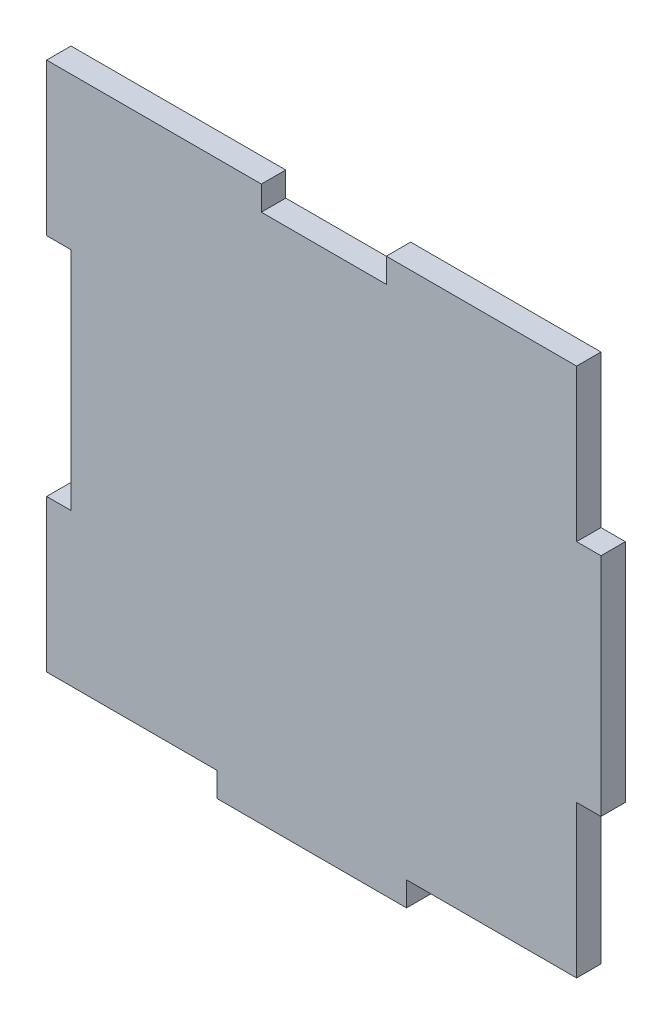
ISO-10303-21;
HEADER;
FILE_DESCRIPTION(('STEP AP214'),'2;1');
FILE_NAME('part.step','',(''),(''),'','','');
FILE_SCHEMA(('AUTOMOTIVE_DESIGN { 1 0 10303 214 1 1 1 1 }'));
ENDSEC;
DATA;
#1=APPLICATION_CONTEXT('core data for automotive mechanical design processes');
#2=APPLICATION_PROTOCOL_DEFINITION('international standard','automotive_design',2000,#1);
#3=PRODUCT_CONTEXT('',#1,'mechanical');
#4=PRODUCT('Part','Part','',(#3));
#5=PRODUCT_RELATED_PRODUCT_CATEGORY('part','',(#4));
#6=PRODUCT_DEFINITION_FORMATION('','',#4);
#7=PRODUCT_DEFINITION_CONTEXT('part definition',#1,'design');
#8=PRODUCT_DEFINITION('design','',#6,#7);
#9=PRODUCT_DEFINITION_SHAPE('','',#8);
#10=(LENGTH_UNIT() NAMED_UNIT(*) SI_UNIT(.MILLI.,.METRE.));
#11=(NAMED_UNIT(*) PLANE_ANGLE_UNIT() SI_UNIT($,.RADIAN.));
#12=(NAMED_UNIT(*) SI_UNIT($,.STERADIAN.) SOLID_ANGLE_UNIT());
#13=UNCERTAINTY_MEASURE_WITH_UNIT(LENGTH_MEASURE(1.E-05),#10,'distance_accuracy_value','');
#14=(GEOMETRIC_REPRESENTATION_CONTEXT(3) GLOBAL_UNCERTAINTY_ASSIGNED_CONTEXT((#13)) GLOBAL_UNIT_ASSIGNED_CONTEXT((#10,
#11,#12)) REPRESENTATION_CONTEXT('',''));
#15=CARTESIAN_POINT('',(0.,0.,0.));
#16=DIRECTION('',(0.,0.,1.));
#17=DIRECTION('',(1.,0.,0.));
#18=AXIS2_PLACEMENT_3D('',#15,#16,#17);
#19=CARTESIAN_POINT('',(0.,100.,4.6));
#20=DIRECTION('',(0.,-1.,0.));
#21=DIRECTION('',(0.,0.,-1.));
#22=AXIS2_PLACEMENT_3D('',#19,#20,#21);
#23=PLANE('',#22);
#24=DIRECTION('',(0.,0.,1.));
#25=VECTOR('',#24,1.);
#26=CARTESIAN_POINT('',(64.0835774926903,100.,0.));
#27=LINE('',#26,#25);
#28=CARTESIAN_POINT('',(64.0835774926903,100.,0.));
#29=VERTEX_POINT('',#28);
#30=CARTESIAN_POINT('',(64.0835774926903,100.,4.60000000000001));
#31=VERTEX_POINT('',#30);
#32=EDGE_CURVE('E579',#29,#31,#27,.T.);
#33=ORIENTED_EDGE('',*,*,#32,.T.);
#34=DIRECTION('',(-1.,0.,0.));
#35=VECTOR('',#34,1.);
#36=CARTESIAN_POINT('',(0.,100.,4.6));
#37=LINE('',#36,#35);
#38=CARTESIAN_POINT('',(100.,100.,4.6));
#39=VERTEX_POINT('',#38);
#40=EDGE_CURVE('E187',#39,#31,#37,.T.);
#41=ORIENTED_EDGE('',*,*,#40,.F.);
#42=DIRECTION('',(0.,0.,-1.));
#43=VECTOR('',#42,1.);
#44=CARTESIAN_POINT('',(100.,100.,4.6));
#45=LINE('',#44,#43);
#46=CARTESIAN_POINT('',(100.,100.,0.));
#47=VERTEX_POINT('',#46);
#48=EDGE_CURVE('E290',#39,#47,#45,.T.);
#49=ORIENTED_EDGE('',*,*,#48,.T.);
#50=DIRECTION('',(-1.,0.,0.));
#51=VECTOR('',#50,1.);
#52=CARTESIAN_POINT('',(0.,100.,0.));
#53=LINE('',#52,#51);
#54=EDGE_CURVE('E295',#47,#29,#53,.T.);
#55=ORIENTED_EDGE('',*,*,#54,.T.);
#56=EDGE_LOOP('',(#33,#41,#49,#55));
#57=FACE_BOUND('',#56,.T.);
#58=ADVANCED_FACE('F31',(#57),#23,.F.);
#59=DIRECTION('',(0.,0.,-1.));
#60=VECTOR('',#59,1.);
#61=CARTESIAN_POINT('',(40.5164225073101,100.,0.));
#62=LINE('',#61,#60);
#63=CARTESIAN_POINT('',(40.5164225073101,100.,4.60000000000001));
#64=VERTEX_POINT('',#63);
#65=CARTESIAN_POINT('',(40.5164225073101,100.,0.));
#66=VERTEX_POINT('',#65);
#67=EDGE_CURVE('E174',#64,#66,#62,.T.);
#68=ORIENTED_EDGE('',*,*,#67,.T.);
#69=CARTESIAN_POINT('',(0.,100.,0.));
#70=VERTEX_POINT('',#69);
#71=EDGE_CURVE('E299',#66,#70,#53,.T.);
#72=ORIENTED_EDGE('',*,*,#71,.T.);
#73=DIRECTION('',(0.,0.,-1.));
#74=VECTOR('',#73,1.);
#75=CARTESIAN_POINT('',(0.,100.,4.6));
#76=LINE('',#75,#74);
#77=CARTESIAN_POINT('',(0.,100.,4.6));
#78=VERTEX_POINT('',#77);
#79=EDGE_CURVE('E258',#78,#70,#76,.T.);
#80=ORIENTED_EDGE('',*,*,#79,.F.);
#81=EDGE_CURVE('E256',#64,#78,#37,.T.);
#82=ORIENTED_EDGE('',*,*,#81,.F.);
#83=EDGE_LOOP('',(#68,#72,#80,#82));
#84=FACE_BOUND('',#83,.T.);
#85=ADVANCED_FACE('F403',(#84),#23,.F.);
#86=CARTESIAN_POINT('',(0.,100.,4.6));
#87=DIRECTION('',(0.,0.,-1.));
#88=DIRECTION('',(-1.,0.,0.));
#89=AXIS2_PLACEMENT_3D('',#86,#87,#88);
#90=PLANE('',#89);
#91=DIRECTION('',(0.,1.,0.));
#92=VECTOR('',#91,1.);
#93=CARTESIAN_POINT('',(64.0835774926903,95.4,4.60000000000001));
#94=LINE('',#93,#92);
#95=CARTESIAN_POINT('',(64.0835774926903,95.4,4.60000000000001));
#96=VERTEX_POINT('',#95);
#97=EDGE_CURVE('E169',#96,#31,#94,.T.);
#98=ORIENTED_EDGE('',*,*,#97,.F.);
#99=DIRECTION('',(-1.,0.,0.));
#100=VECTOR('',#99,1.);
#101=CARTESIAN_POINT('',(40.5164225073101,95.4,4.60000000000001));
#102=LINE('',#101,#100);
#103=CARTESIAN_POINT('',(40.5164225073101,95.4,4.60000000000001));
#104=VERTEX_POINT('',#103);
#105=EDGE_CURVE('E173',#96,#104,#102,.T.);
#106=ORIENTED_EDGE('',*,*,#105,.T.);
#107=DIRECTION('',(0.,1.,0.));
#108=VECTOR('',#107,1.);
#109=CARTESIAN_POINT('',(40.5164225073101,95.4,4.60000000000001));
#110=LINE('',#109,#108);
#111=EDGE_CURVE('E188',#104,#64,#110,.T.);
#112=ORIENTED_EDGE('',*,*,#111,.T.);
#113=ORIENTED_EDGE('',*,*,#81,.T.);
#114=DIRECTION('',(0.,-1.,0.));
#115=VECTOR('',#114,1.);
#116=CARTESIAN_POINT('',(0.,0.,4.6));
#117=LINE('',#116,#115);
#118=CARTESIAN_POINT('',(0.,71.3036640249381,4.6));
#119=VERTEX_POINT('',#118);
#120=EDGE_CURVE('E239',#78,#119,#117,.T.);
#121=ORIENTED_EDGE('',*,*,#120,.T.);
#122=DIRECTION('',(-1.,0.,0.));
#123=VECTOR('',#122,1.);
#124=CARTESIAN_POINT('',(0.,71.3036640249381,4.6));
#125=LINE('',#124,#123);
#126=CARTESIAN_POINT('',(4.6,71.3036640249381,4.6));
#127=VERTEX_POINT('',#126);
#128=EDGE_CURVE('E365',#127,#119,#125,.T.);
#129=ORIENTED_EDGE('',*,*,#128,.F.);
#130=DIRECTION('',(0.,1.,0.));
#131=VECTOR('',#130,1.);
#132=CARTESIAN_POINT('',(4.6,71.3036640249381,4.6));
#133=LINE('',#132,#131);
#134=CARTESIAN_POINT('',(4.6,28.6963359750619,4.6));
#135=VERTEX_POINT('',#134);
#136=EDGE_CURVE('E380',#135,#127,#133,.T.);
#137=ORIENTED_EDGE('',*,*,#136,.F.);
#138=DIRECTION('',(1.,0.,0.));
#139=VECTOR('',#138,1.);
#140=CARTESIAN_POINT('',(0.,28.6963359750619,4.6));
#141=LINE('',#140,#139);
#142=CARTESIAN_POINT('',(0.,28.6963359750619,4.6));
#143=VERTEX_POINT('',#142);
#144=EDGE_CURVE('E227',#143,#135,#141,.T.);
#145=ORIENTED_EDGE('',*,*,#144,.F.);
#146=CARTESIAN_POINT('',(0.,0.,4.6));
#147=VERTEX_POINT('',#146);
#148=EDGE_CURVE('E298',#143,#147,#117,.T.);
#149=ORIENTED_EDGE('',*,*,#148,.T.);
#150=DIRECTION('',(1.,0.,0.));
#151=VECTOR('',#150,1.);
#152=CARTESIAN_POINT('',(0.,0.,4.6));
#153=LINE('',#152,#151);
#154=CARTESIAN_POINT('',(32.1486461115883,0.,4.6));
#155=VERTEX_POINT('',#154);
#156=EDGE_CURVE('E238',#147,#155,#153,.T.);
#157=ORIENTED_EDGE('',*,*,#156,.T.);
#158=DIRECTION('',(0.,-1.,0.));
#159=VECTOR('',#158,1.);
#160=CARTESIAN_POINT('',(32.1486461115883,0.,4.6));
#161=LINE('',#160,#159);
#162=CARTESIAN_POINT('',(32.1486461115883,-4.6,4.6));
#163=VERTEX_POINT('',#162);
#164=EDGE_CURVE('E54',#155,#163,#161,.T.);
#165=ORIENTED_EDGE('',*,*,#164,.T.);
#166=DIRECTION('',(1.,0.,0.));
#167=VECTOR('',#166,1.);
#168=CARTESIAN_POINT('',(32.1486461115883,-4.6,4.6));
#169=LINE('',#168,#167);
#170=CARTESIAN_POINT('',(67.9078197430592,-4.6,4.6));
#171=VERTEX_POINT('',#170);
#172=EDGE_CURVE('E196',#163,#171,#169,.T.);
#173=ORIENTED_EDGE('',*,*,#172,.T.);
#174=DIRECTION('',(0.,1.,0.));
#175=VECTOR('',#174,1.);
#176=CARTESIAN_POINT('',(67.9078197430592,0.,4.6));
#177=LINE('',#176,#175);
#178=CARTESIAN_POINT('',(67.9078197430592,0.,4.6));
#179=VERTEX_POINT('',#178);
#180=EDGE_CURVE('E190',#171,#179,#177,.T.);
#181=ORIENTED_EDGE('',*,*,#180,.T.);
#182=CARTESIAN_POINT('',(100.,0.,4.6));
#183=VERTEX_POINT('',#182);
#184=EDGE_CURVE('E235',#179,#183,#153,.T.);
#185=ORIENTED_EDGE('',*,*,#184,.T.);
#186=DIRECTION('',(0.,1.,0.));
#187=VECTOR('',#186,1.);
#188=CARTESIAN_POINT('',(100.,0.,4.6));
#189=LINE('',#188,#187);
#190=CARTESIAN_POINT('',(100.,28.6963359750619,4.6));
#191=VERTEX_POINT('',#190);
#192=EDGE_CURVE('E245',#183,#191,#189,.T.);
#193=ORIENTED_EDGE('',*,*,#192,.T.);
#194=DIRECTION('',(1.,0.,0.));
#195=VECTOR('',#194,1.);
#196=CARTESIAN_POINT('',(100.,28.6963359750619,4.6));
#197=LINE('',#196,#195);
#198=CARTESIAN_POINT('',(104.6,28.6963359750619,4.6));
#199=VERTEX_POINT('',#198);
#200=EDGE_CURVE('E248',#191,#199,#197,.T.);
#201=ORIENTED_EDGE('',*,*,#200,.T.);
#202=DIRECTION('',(0.,1.,0.));
#203=VECTOR('',#202,1.);
#204=CARTESIAN_POINT('',(104.6,28.6963359750619,4.6));
#205=LINE('',#204,#203);
#206=CARTESIAN_POINT('',(104.6,71.3036640249381,4.6));
#207=VERTEX_POINT('',#206);
#208=EDGE_CURVE('E250',#199,#207,#205,.T.);
#209=ORIENTED_EDGE('',*,*,#208,.T.);
#210=DIRECTION('',(-1.,0.,0.));
#211=VECTOR('',#210,1.);
#212=CARTESIAN_POINT('',(100.,71.3036640249381,4.6));
#213=LINE('',#212,#211);
#214=CARTESIAN_POINT('',(100.,71.3036640249381,4.6));
#215=VERTEX_POINT('',#214);
#216=EDGE_CURVE('E252',#207,#215,#213,.T.);
#217=ORIENTED_EDGE('',*,*,#216,.T.);
#218=DIRECTION('',(0.,1.,0.));
#219=VECTOR('',#218,1.);
#220=CARTESIAN_POINT('',(100.,71.3036640249381,4.6));
#221=LINE('',#220,#219);
#222=EDGE_CURVE('E254',#215,#39,#221,.T.);
#223=ORIENTED_EDGE('',*,*,#222,.T.);
#224=ORIENTED_EDGE('',*,*,#40,.T.);
#225=EDGE_LOOP('',(#98,#106,#112,#113,#121,#129,#137,#145,#149,#157,#165,#173,#181,#185,#193,
#201,#209,#217,#223,#224));
#226=FACE_BOUND('',#225,.T.);
#227=ADVANCED_FACE('F185',(#226),#90,.F.);
#228=CARTESIAN_POINT('',(0.,100.,0.));
#229=DIRECTION('',(0.,0.,-1.));
#230=DIRECTION('',(-1.,0.,0.));
#231=AXIS2_PLACEMENT_3D('',#228,#229,#230);
#232=PLANE('',#231);
#233=DIRECTION('',(0.,-1.,0.));
#234=VECTOR('',#233,1.);
#235=CARTESIAN_POINT('',(0.,0.,0.));
#236=LINE('',#235,#234);
#237=CARTESIAN_POINT('',(0.,71.3036640249381,0.));
#238=VERTEX_POINT('',#237);
#239=EDGE_CURVE('E259',#70,#238,#236,.T.);
#240=ORIENTED_EDGE('',*,*,#239,.F.);
#241=ORIENTED_EDGE('',*,*,#71,.F.);
#242=DIRECTION('',(0.,1.,0.));
#243=VECTOR('',#242,1.);
#244=CARTESIAN_POINT('',(40.5164225073101,95.4,0.));
#245=LINE('',#244,#243);
#246=CARTESIAN_POINT('',(40.5164225073101,95.4,0.));
#247=VERTEX_POINT('',#246);
#248=EDGE_CURVE('E192',#247,#66,#245,.T.);
#249=ORIENTED_EDGE('',*,*,#248,.F.);
#250=DIRECTION('',(-1.,0.,0.));
#251=VECTOR('',#250,1.);
#252=CARTESIAN_POINT('',(0.,95.4,0.));
#253=LINE('',#252,#251);
#254=CARTESIAN_POINT('',(64.0835774926903,95.4,0.));
#255=VERTEX_POINT('',#254);
#256=EDGE_CURVE('E11',#255,#247,#253,.T.);
#257=ORIENTED_EDGE('',*,*,#256,.F.);
#258=DIRECTION('',(0.,1.,0.));
#259=VECTOR('',#258,1.);
#260=CARTESIAN_POINT('',(64.0835774926903,95.4,0.));
#261=LINE('',#260,#259);
#262=EDGE_CURVE('E46',#255,#29,#261,.T.);
#263=ORIENTED_EDGE('',*,*,#262,.T.);
#264=ORIENTED_EDGE('',*,*,#54,.F.);
#265=DIRECTION('',(0.,1.,0.));
#266=VECTOR('',#265,1.);
#267=CARTESIAN_POINT('',(100.,71.3036640249381,0.));
#268=LINE('',#267,#266);
#269=CARTESIAN_POINT('',(100.,71.3036640249381,0.));
#270=VERTEX_POINT('',#269);
#271=EDGE_CURVE('E300',#270,#47,#268,.T.);
#272=ORIENTED_EDGE('',*,*,#271,.F.);
#273=DIRECTION('',(-1.,0.,0.));
#274=VECTOR('',#273,1.);
#275=CARTESIAN_POINT('',(100.,71.3036640249381,0.));
#276=LINE('',#275,#274);
#277=CARTESIAN_POINT('',(104.6,71.3036640249381,0.));
#278=VERTEX_POINT('',#277);
#279=EDGE_CURVE('E302',#278,#270,#276,.T.);
#280=ORIENTED_EDGE('',*,*,#279,.F.);
#281=DIRECTION('',(0.,1.,0.));
#282=VECTOR('',#281,1.);
#283=CARTESIAN_POINT('',(104.6,28.6963359750619,0.));
#284=LINE('',#283,#282);
#285=CARTESIAN_POINT('',(104.6,28.6963359750619,0.));
#286=VERTEX_POINT('',#285);
#287=EDGE_CURVE('E304',#286,#278,#284,.T.);
#288=ORIENTED_EDGE('',*,*,#287,.F.);
#289=DIRECTION('',(1.,0.,0.));
#290=VECTOR('',#289,1.);
#291=CARTESIAN_POINT('',(100.,28.6963359750619,0.));
#292=LINE('',#291,#290);
#293=CARTESIAN_POINT('',(100.,28.6963359750619,0.));
#294=VERTEX_POINT('',#293);
#295=EDGE_CURVE('E305',#294,#286,#292,.T.);
#296=ORIENTED_EDGE('',*,*,#295,.F.);
#297=DIRECTION('',(0.,1.,0.));
#298=VECTOR('',#297,1.);
#299=CARTESIAN_POINT('',(100.,0.,0.));
#300=LINE('',#299,#298);
#301=CARTESIAN_POINT('',(100.,0.,0.));
#302=VERTEX_POINT('',#301);
#303=EDGE_CURVE('E266',#302,#294,#300,.T.);
#304=ORIENTED_EDGE('',*,*,#303,.F.);
#305=DIRECTION('',(1.,0.,0.));
#306=VECTOR('',#305,1.);
#307=CARTESIAN_POINT('',(0.,0.,0.));
#308=LINE('',#307,#306);
#309=CARTESIAN_POINT('',(67.9078197430592,0.,0.));
#310=VERTEX_POINT('',#309);
#311=EDGE_CURVE('E262',#310,#302,#308,.T.);
#312=ORIENTED_EDGE('',*,*,#311,.F.);
#313=DIRECTION('',(0.,1.,0.));
#314=VECTOR('',#313,1.);
#315=CARTESIAN_POINT('',(67.9078197430592,0.,0.));
#316=LINE('',#315,#314);
#317=CARTESIAN_POINT('',(67.9078197430592,-4.6,0.));
#318=VERTEX_POINT('',#317);
#319=EDGE_CURVE('E206',#318,#310,#316,.T.);
#320=ORIENTED_EDGE('',*,*,#319,.F.);
#321=DIRECTION('',(1.,0.,0.));
#322=VECTOR('',#321,1.);
#323=CARTESIAN_POINT('',(32.1486461115883,-4.6,0.));
#324=LINE('',#323,#322);
#325=CARTESIAN_POINT('',(32.1486461115883,-4.6,0.));
#326=VERTEX_POINT('',#325);
#327=EDGE_CURVE('E200',#326,#318,#324,.T.);
#328=ORIENTED_EDGE('',*,*,#327,.F.);
#329=DIRECTION('',(0.,-1.,0.));
#330=VECTOR('',#329,1.);
#331=CARTESIAN_POINT('',(32.1486461115883,0.,0.));
#332=LINE('',#331,#330);
#333=CARTESIAN_POINT('',(32.1486461115883,0.,0.));
#334=VERTEX_POINT('',#333);
#335=EDGE_CURVE('E208',#334,#326,#332,.T.);
#336=ORIENTED_EDGE('',*,*,#335,.F.);
#337=CARTESIAN_POINT('',(0.,0.,0.));
#338=VERTEX_POINT('',#337);
#339=EDGE_CURVE('E270',#338,#334,#308,.T.);
#340=ORIENTED_EDGE('',*,*,#339,.F.);
#341=CARTESIAN_POINT('',(0.,28.6963359750619,0.));
#342=VERTEX_POINT('',#341);
#343=EDGE_CURVE('E263',#342,#338,#236,.T.);
#344=ORIENTED_EDGE('',*,*,#343,.F.);
#345=DIRECTION('',(1.,0.,0.));
#346=VECTOR('',#345,1.);
#347=CARTESIAN_POINT('',(0.,28.6963359750619,0.));
#348=LINE('',#347,#346);
#349=CARTESIAN_POINT('',(4.6,28.6963359750619,0.));
#350=VERTEX_POINT('',#349);
#351=EDGE_CURVE('E377',#342,#350,#348,.T.);
#352=ORIENTED_EDGE('',*,*,#351,.T.);
#353=DIRECTION('',(0.,1.,0.));
#354=VECTOR('',#353,1.);
#355=CARTESIAN_POINT('',(4.6,71.3036640249381,0.));
#356=LINE('',#355,#354);
#357=CARTESIAN_POINT('',(4.6,71.3036640249381,0.));
#358=VERTEX_POINT('',#357);
#359=EDGE_CURVE('E373',#350,#358,#356,.T.);
#360=ORIENTED_EDGE('',*,*,#359,.T.);
#361=DIRECTION('',(-1.,0.,0.));
#362=VECTOR('',#361,1.);
#363=CARTESIAN_POINT('',(0.,71.3036640249381,0.));
#364=LINE('',#363,#362);
#365=EDGE_CURVE('E368',#358,#238,#364,.T.);
#366=ORIENTED_EDGE('',*,*,#365,.T.);
#367=EDGE_LOOP('',(#240,#241,#249,#257,#263,#264,#272,#280,#288,#296,#304,#312,#320,#328,#336,
#340,#344,#352,#360,#366));
#368=FACE_BOUND('',#367,.T.);
#369=ADVANCED_FACE('F321',(#368),#232,.T.);
#370=CARTESIAN_POINT('',(0.,0.,4.6));
#371=DIRECTION('',(0.,1.,0.));
#372=DIRECTION('',(0.,0.,1.));
#373=AXIS2_PLACEMENT_3D('',#370,#371,#372);
#374=PLANE('',#373);
#375=DIRECTION('',(0.,0.,1.));
#376=VECTOR('',#375,1.);
#377=CARTESIAN_POINT('',(67.9078197430592,0.,-36.0538277968606));
#378=LINE('',#377,#376);
#379=EDGE_CURVE('E223',#310,#179,#378,.T.);
#380=ORIENTED_EDGE('',*,*,#379,.F.);
#381=ORIENTED_EDGE('',*,*,#311,.T.);
#382=DIRECTION('',(0.,0.,-1.));
#383=VECTOR('',#382,1.);
#384=CARTESIAN_POINT('',(100.,0.,4.6));
#385=LINE('',#384,#383);
#386=EDGE_CURVE('E275',#183,#302,#385,.T.);
#387=ORIENTED_EDGE('',*,*,#386,.F.);
#388=ORIENTED_EDGE('',*,*,#184,.F.);
#389=EDGE_LOOP('',(#380,#381,#387,#388));
#390=FACE_BOUND('',#389,.T.);
#391=ADVANCED_FACE('F336',(#390),#374,.F.);
#392=CARTESIAN_POINT('',(0.,0.,4.6));
#393=DIRECTION('',(1.,0.,0.));
#394=DIRECTION('',(0.,0.,-1.));
#395=AXIS2_PLACEMENT_3D('',#392,#393,#394);
#396=PLANE('',#395);
#397=ORIENTED_EDGE('',*,*,#239,.T.);
#398=DIRECTION('',(0.,0.,1.));
#399=VECTOR('',#398,1.);
#400=CARTESIAN_POINT('',(0.,71.3036640249381,0.));
#401=LINE('',#400,#399);
#402=EDGE_CURVE('E355',#238,#119,#401,.T.);
#403=ORIENTED_EDGE('',*,*,#402,.T.);
#404=ORIENTED_EDGE('',*,*,#120,.F.);
#405=ORIENTED_EDGE('',*,*,#79,.T.);
#406=EDGE_LOOP('',(#397,#403,#404,#405));
#407=FACE_BOUND('',#406,.T.);
#408=ADVANCED_FACE('F425',(#407),#396,.F.);
#409=ORIENTED_EDGE('',*,*,#148,.F.);
#410=DIRECTION('',(0.,0.,1.));
#411=VECTOR('',#410,1.);
#412=CARTESIAN_POINT('',(0.,28.6963359750619,0.));
#413=LINE('',#412,#411);
#414=EDGE_CURVE('E354',#342,#143,#413,.T.);
#415=ORIENTED_EDGE('',*,*,#414,.F.);
#416=ORIENTED_EDGE('',*,*,#343,.T.);
#417=DIRECTION('',(0.,0.,-1.));
#418=VECTOR('',#417,1.);
#419=CARTESIAN_POINT('',(0.,0.,4.6));
#420=LINE('',#419,#418);
#421=EDGE_CURVE('E39',#147,#338,#420,.T.);
#422=ORIENTED_EDGE('',*,*,#421,.F.);
#423=EDGE_LOOP('',(#409,#415,#416,#422));
#424=FACE_BOUND('',#423,.T.);
#425=ADVANCED_FACE('F33',(#424),#396,.F.);
#426=ORIENTED_EDGE('',*,*,#339,.T.);
#427=DIRECTION('',(0.,0.,1.));
#428=VECTOR('',#427,1.);
#429=CARTESIAN_POINT('',(32.1486461115883,0.,-36.0538277968606));
#430=LINE('',#429,#428);
#431=EDGE_CURVE('E199',#334,#155,#430,.T.);
#432=ORIENTED_EDGE('',*,*,#431,.T.);
#433=ORIENTED_EDGE('',*,*,#156,.F.);
#434=ORIENTED_EDGE('',*,*,#421,.T.);
#435=EDGE_LOOP('',(#426,#432,#433,#434));
#436=FACE_BOUND('',#435,.T.);
#437=ADVANCED_FACE('F350',(#436),#374,.F.);
#438=CARTESIAN_POINT('',(100.,0.,4.6));
#439=DIRECTION('',(-1.,0.,0.));
#440=DIRECTION('',(0.,0.,1.));
#441=AXIS2_PLACEMENT_3D('',#438,#439,#440);
#442=PLANE('',#441);
#443=ORIENTED_EDGE('',*,*,#303,.T.);
#444=DIRECTION('',(0.,0.,-1.));
#445=VECTOR('',#444,1.);
#446=CARTESIAN_POINT('',(100.,28.6963359750619,4.6));
#447=LINE('',#446,#445);
#448=EDGE_CURVE('E278',#191,#294,#447,.T.);
#449=ORIENTED_EDGE('',*,*,#448,.F.);
#450=ORIENTED_EDGE('',*,*,#192,.F.);
#451=ORIENTED_EDGE('',*,*,#386,.T.);
#452=EDGE_LOOP('',(#443,#449,#450,#451));
#453=FACE_BOUND('',#452,.T.);
#454=ADVANCED_FACE('F312',(#453),#442,.F.);
#455=CARTESIAN_POINT('',(100.,28.6963359750619,4.6));
#456=DIRECTION('',(0.,1.,0.));
#457=DIRECTION('',(0.,0.,1.));
#458=AXIS2_PLACEMENT_3D('',#455,#456,#457);
#459=PLANE('',#458);
#460=ORIENTED_EDGE('',*,*,#295,.T.);
#461=DIRECTION('',(0.,0.,-1.));
#462=VECTOR('',#461,1.);
#463=CARTESIAN_POINT('',(104.6,28.6963359750619,4.6));
#464=LINE('',#463,#462);
#465=EDGE_CURVE('E281',#199,#286,#464,.T.);
#466=ORIENTED_EDGE('',*,*,#465,.F.);
#467=ORIENTED_EDGE('',*,*,#200,.F.);
#468=ORIENTED_EDGE('',*,*,#448,.T.);
#469=EDGE_LOOP('',(#460,#466,#467,#468));
#470=FACE_BOUND('',#469,.T.);
#471=ADVANCED_FACE('F318',(#470),#459,.F.);
#472=CARTESIAN_POINT('',(104.6,28.6963359750619,4.6));
#473=DIRECTION('',(-1.,0.,0.));
#474=DIRECTION('',(0.,0.,1.));
#475=AXIS2_PLACEMENT_3D('',#472,#473,#474);
#476=PLANE('',#475);
#477=ORIENTED_EDGE('',*,*,#287,.T.);
#478=DIRECTION('',(0.,0.,-1.));
#479=VECTOR('',#478,1.);
#480=CARTESIAN_POINT('',(104.6,71.3036640249381,4.6));
#481=LINE('',#480,#479);
#482=EDGE_CURVE('E284',#207,#278,#481,.T.);
#483=ORIENTED_EDGE('',*,*,#482,.F.);
#484=ORIENTED_EDGE('',*,*,#208,.F.);
#485=ORIENTED_EDGE('',*,*,#465,.T.);
#486=EDGE_LOOP('',(#477,#483,#484,#485));
#487=FACE_BOUND('',#486,.T.);
#488=ADVANCED_FACE('F326',(#487),#476,.F.);
#489=CARTESIAN_POINT('',(100.,71.3036640249381,4.6));
#490=DIRECTION('',(0.,-1.,0.));
#491=DIRECTION('',(0.,0.,-1.));
#492=AXIS2_PLACEMENT_3D('',#489,#490,#491);
#493=PLANE('',#492);
#494=ORIENTED_EDGE('',*,*,#279,.T.);
#495=DIRECTION('',(0.,0.,-1.));
#496=VECTOR('',#495,1.);
#497=CARTESIAN_POINT('',(100.,71.3036640249381,4.6));
#498=LINE('',#497,#496);
#499=EDGE_CURVE('E287',#215,#270,#498,.T.);
#500=ORIENTED_EDGE('',*,*,#499,.F.);
#501=ORIENTED_EDGE('',*,*,#216,.F.);
#502=ORIENTED_EDGE('',*,*,#482,.T.);
#503=EDGE_LOOP('',(#494,#500,#501,#502));
#504=FACE_BOUND('',#503,.T.);
#505=ADVANCED_FACE('F330',(#504),#493,.F.);
#506=CARTESIAN_POINT('',(100.,71.3036640249381,4.6));
#507=DIRECTION('',(-1.,0.,0.));
#508=DIRECTION('',(0.,0.,1.));
#509=AXIS2_PLACEMENT_3D('',#506,#507,#508);
#510=PLANE('',#509);
#511=ORIENTED_EDGE('',*,*,#271,.T.);
#512=ORIENTED_EDGE('',*,*,#48,.F.);
#513=ORIENTED_EDGE('',*,*,#222,.F.);
#514=ORIENTED_EDGE('',*,*,#499,.T.);
#515=EDGE_LOOP('',(#511,#512,#513,#514));
#516=FACE_BOUND('',#515,.T.);
#517=ADVANCED_FACE('F391',(#516),#510,.F.);
#518=CARTESIAN_POINT('',(0.,71.3036640249381,0.));
#519=DIRECTION('',(0.,1.,0.));
#520=DIRECTION('',(-1.,0.,0.));
#521=AXIS2_PLACEMENT_3D('',#518,#519,#520);
#522=PLANE('',#521);
#523=ORIENTED_EDGE('',*,*,#128,.T.);
#524=ORIENTED_EDGE('',*,*,#402,.F.);
#525=ORIENTED_EDGE('',*,*,#365,.F.);
#526=DIRECTION('',(0.,0.,1.));
#527=VECTOR('',#526,1.);
#528=CARTESIAN_POINT('',(4.6,71.3036640249381,0.));
#529=LINE('',#528,#527);
#530=EDGE_CURVE('E357',#358,#127,#529,.T.);
#531=ORIENTED_EDGE('',*,*,#530,.T.);
#532=EDGE_LOOP('',(#523,#524,#525,#531));
#533=FACE_BOUND('',#532,.T.);
#534=ADVANCED_FACE('F389',(#533),#522,.F.);
#535=CARTESIAN_POINT('',(4.6,71.3036640249381,0.));
#536=DIRECTION('',(1.,0.,0.));
#537=DIRECTION('',(0.,1.,0.));
#538=AXIS2_PLACEMENT_3D('',#535,#536,#537);
#539=PLANE('',#538);
#540=ORIENTED_EDGE('',*,*,#136,.T.);
#541=ORIENTED_EDGE('',*,*,#530,.F.);
#542=ORIENTED_EDGE('',*,*,#359,.F.);
#543=DIRECTION('',(0.,0.,1.));
#544=VECTOR('',#543,1.);
#545=CARTESIAN_POINT('',(4.6,28.6963359750619,0.));
#546=LINE('',#545,#544);
#547=EDGE_CURVE('E362',#350,#135,#546,.T.);
#548=ORIENTED_EDGE('',*,*,#547,.T.);
#549=EDGE_LOOP('',(#540,#541,#542,#548));
#550=FACE_BOUND('',#549,.T.);
#551=ADVANCED_FACE('F388',(#550),#539,.F.);
#552=CARTESIAN_POINT('',(0.,28.6963359750619,0.));
#553=DIRECTION('',(0.,-1.,0.));
#554=DIRECTION('',(1.,0.,0.));
#555=AXIS2_PLACEMENT_3D('',#552,#553,#554);
#556=PLANE('',#555);
#557=ORIENTED_EDGE('',*,*,#144,.T.);
#558=ORIENTED_EDGE('',*,*,#547,.F.);
#559=ORIENTED_EDGE('',*,*,#351,.F.);
#560=ORIENTED_EDGE('',*,*,#414,.T.);
#561=EDGE_LOOP('',(#557,#558,#559,#560));
#562=FACE_BOUND('',#561,.T.);
#563=ADVANCED_FACE('F387',(#562),#556,.F.);
#564=CARTESIAN_POINT('',(32.1486461115883,0.,-36.0538277968606));
#565=DIRECTION('',(-1.,0.,0.));
#566=DIRECTION('',(0.,0.,1.));
#567=AXIS2_PLACEMENT_3D('',#564,#565,#566);
#568=PLANE('',#567);
#569=ORIENTED_EDGE('',*,*,#431,.F.);
#570=ORIENTED_EDGE('',*,*,#335,.T.);
#571=DIRECTION('',(0.,0.,1.));
#572=VECTOR('',#571,1.);
#573=CARTESIAN_POINT('',(32.1486461115883,-4.6,-36.0538277968606));
#574=LINE('',#573,#572);
#575=EDGE_CURVE('E204',#326,#163,#574,.T.);
#576=ORIENTED_EDGE('',*,*,#575,.T.);
#577=ORIENTED_EDGE('',*,*,#164,.F.);
#578=EDGE_LOOP('',(#569,#570,#576,#577));
#579=FACE_BOUND('',#578,.T.);
#580=ADVANCED_FACE('F343',(#579),#568,.T.);
#581=CARTESIAN_POINT('',(32.1486461115883,-4.6,-36.0538277968606));
#582=DIRECTION('',(0.,-1.,0.));
#583=DIRECTION('',(0.,0.,-1.));
#584=AXIS2_PLACEMENT_3D('',#581,#582,#583);
#585=PLANE('',#584);
#586=ORIENTED_EDGE('',*,*,#575,.F.);
#587=ORIENTED_EDGE('',*,*,#327,.T.);
#588=DIRECTION('',(0.,0.,1.));
#589=VECTOR('',#588,1.);
#590=CARTESIAN_POINT('',(67.9078197430592,-4.6,-36.0538277968606));
#591=LINE('',#590,#589);
#592=EDGE_CURVE('E203',#318,#171,#591,.T.);
#593=ORIENTED_EDGE('',*,*,#592,.T.);
#594=ORIENTED_EDGE('',*,*,#172,.F.);
#595=EDGE_LOOP('',(#586,#587,#593,#594));
#596=FACE_BOUND('',#595,.T.);
#597=ADVANCED_FACE('F342',(#596),#585,.T.);
#598=CARTESIAN_POINT('',(67.9078197430592,0.,-36.0538277968606));
#599=DIRECTION('',(1.,0.,0.));
#600=DIRECTION('',(0.,0.,-1.));
#601=AXIS2_PLACEMENT_3D('',#598,#599,#600);
#602=PLANE('',#601);
#603=ORIENTED_EDGE('',*,*,#592,.F.);
#604=ORIENTED_EDGE('',*,*,#319,.T.);
#605=ORIENTED_EDGE('',*,*,#379,.T.);
#606=ORIENTED_EDGE('',*,*,#180,.F.);
#607=EDGE_LOOP('',(#603,#604,#605,#606));
#608=FACE_BOUND('',#607,.T.);
#609=ADVANCED_FACE('F340',(#608),#602,.T.);
#610=CARTESIAN_POINT('',(64.0835774926903,95.4,0.));
#611=DIRECTION('',(-1.,0.,0.));
#612=DIRECTION('',(0.,-1.,0.));
#613=AXIS2_PLACEMENT_3D('',#610,#611,#612);
#614=PLANE('',#613);
#615=ORIENTED_EDGE('',*,*,#32,.F.);
#616=ORIENTED_EDGE('',*,*,#262,.F.);
#617=DIRECTION('',(0.,0.,1.));
#618=VECTOR('',#617,1.);
#619=CARTESIAN_POINT('',(64.0835774926903,95.4,0.));
#620=LINE('',#619,#618);
#621=EDGE_CURVE('E165',#255,#96,#620,.T.);
#622=ORIENTED_EDGE('',*,*,#621,.T.);
#623=ORIENTED_EDGE('',*,*,#97,.T.);
#624=EDGE_LOOP('',(#615,#616,#622,#623));
#625=FACE_BOUND('',#624,.T.);
#626=ADVANCED_FACE('F167',(#625),#614,.T.);
#627=CARTESIAN_POINT('',(40.5164225073101,95.4,0.));
#628=DIRECTION('',(1.,0.,0.));
#629=DIRECTION('',(0.,1.,0.));
#630=AXIS2_PLACEMENT_3D('',#627,#628,#629);
#631=PLANE('',#630);
#632=ORIENTED_EDGE('',*,*,#67,.F.);
#633=ORIENTED_EDGE('',*,*,#111,.F.);
#634=DIRECTION('',(0.,0.,-1.));
#635=VECTOR('',#634,1.);
#636=CARTESIAN_POINT('',(40.5164225073101,95.4,0.));
#637=LINE('',#636,#635);
#638=EDGE_CURVE('E180',#104,#247,#637,.T.);
#639=ORIENTED_EDGE('',*,*,#638,.T.);
#640=ORIENTED_EDGE('',*,*,#248,.T.);
#641=EDGE_LOOP('',(#632,#633,#639,#640));
#642=FACE_BOUND('',#641,.T.);
#643=ADVANCED_FACE('F450',(#642),#631,.T.);
#644=CARTESIAN_POINT('',(100.,95.4,0.));
#645=DIRECTION('',(0.,-1.,0.));
#646=DIRECTION('',(1.,0.,0.));
#647=AXIS2_PLACEMENT_3D('',#644,#645,#646);
#648=PLANE('',#647);
#649=ORIENTED_EDGE('',*,*,#256,.T.);
#650=ORIENTED_EDGE('',*,*,#638,.F.);
#651=ORIENTED_EDGE('',*,*,#105,.F.);
#652=ORIENTED_EDGE('',*,*,#621,.F.);
#653=EDGE_LOOP('',(#649,#650,#651,#652));
#654=FACE_BOUND('',#653,.T.);
#655=ADVANCED_FACE('F178',(#654),#648,.F.);
#656=CLOSED_SHELL('',(#58,#85,#227,#369,#391,#408,#425,#437,#454,#471,#488,#505,#517,#534,#551,
#563,#580,#597,#609,#626,#643,#655));
#657=MANIFOLD_SOLID_BREP('B2',#656);
#658=ADVANCED_BREP_SHAPE_REPRESENTATION('',(#18,#657),#14);
#659=SHAPE_DEFINITION_REPRESENTATION(#9,#658);
ENDSEC;
END-ISO-10303-21;
